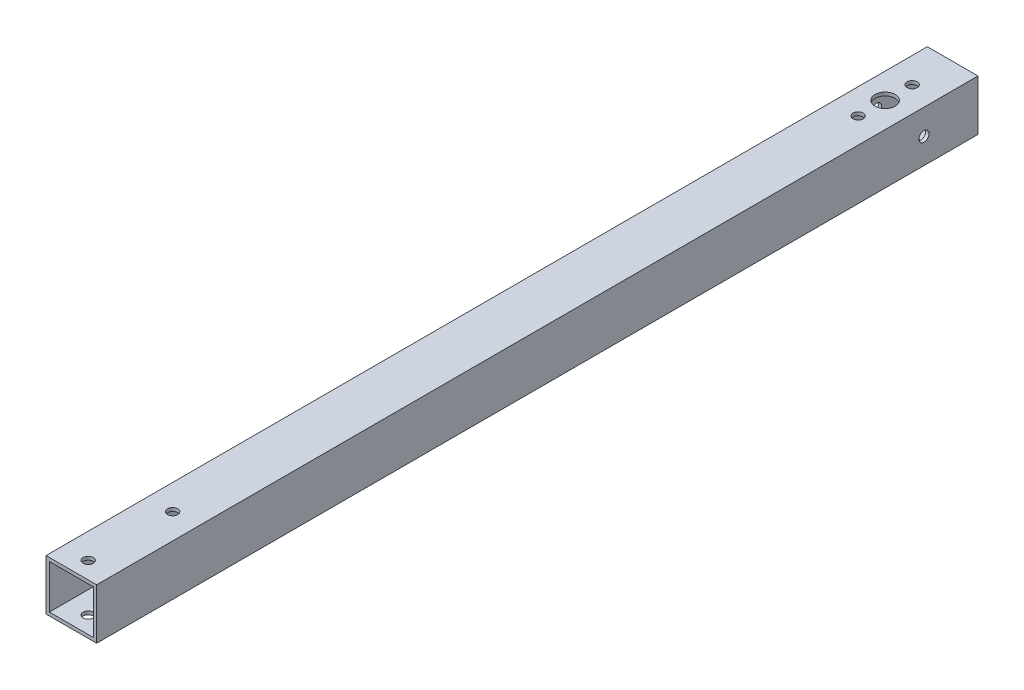
ISO-10303-21;
HEADER;
FILE_DESCRIPTION(('STEP AP214'),'2;1');
FILE_NAME('part.step','',(''),(''),'','','');
FILE_SCHEMA(('AUTOMOTIVE_DESIGN { 1 0 10303 214 1 1 1 1 }'));
ENDSEC;
DATA;
#1=APPLICATION_CONTEXT('core data for automotive mechanical design processes');
#2=APPLICATION_PROTOCOL_DEFINITION('international standard','automotive_design',2000,#1);
#3=PRODUCT_CONTEXT('',#1,'mechanical');
#4=PRODUCT('Part','Part','',(#3));
#5=PRODUCT_RELATED_PRODUCT_CATEGORY('part','',(#4));
#6=PRODUCT_DEFINITION_FORMATION('','',#4);
#7=PRODUCT_DEFINITION_CONTEXT('part definition',#1,'design');
#8=PRODUCT_DEFINITION('design','',#6,#7);
#9=PRODUCT_DEFINITION_SHAPE('','',#8);
#10=(LENGTH_UNIT() NAMED_UNIT(*) SI_UNIT(.MILLI.,.METRE.));
#11=(NAMED_UNIT(*) PLANE_ANGLE_UNIT() SI_UNIT($,.RADIAN.));
#12=(NAMED_UNIT(*) SI_UNIT($,.STERADIAN.) SOLID_ANGLE_UNIT());
#13=UNCERTAINTY_MEASURE_WITH_UNIT(LENGTH_MEASURE(1.E-05),#10,'distance_accuracy_value','');
#14=(GEOMETRIC_REPRESENTATION_CONTEXT(3) GLOBAL_UNCERTAINTY_ASSIGNED_CONTEXT((#13)) GLOBAL_UNIT_ASSIGNED_CONTEXT((#10,
#11,#12)) REPRESENTATION_CONTEXT('',''));
#15=CARTESIAN_POINT('',(0.,0.,0.));
#16=DIRECTION('',(0.,0.,1.));
#17=DIRECTION('',(1.,0.,0.));
#18=AXIS2_PLACEMENT_3D('',#15,#16,#17);
#19=CARTESIAN_POINT('',(-44.2961417863926,22.1480708931963,261.));
#20=DIRECTION('',(1.,0.,0.));
#21=DIRECTION('',(0.,0.,-1.));
#22=AXIS2_PLACEMENT_3D('',#19,#20,#21);
#23=PLANE('',#22);
#24=CARTESIAN_POINT('',(-44.2961417863926,14.6480708931963,16.));
#25=DIRECTION('',(-1.,0.,0.));
#26=DIRECTION('',(0.,0.,1.));
#27=AXIS2_PLACEMENT_3D('',#24,#25,#26);
#28=CIRCLE('',#27,1.49999999999999);
#29=CARTESIAN_POINT('',(-44.2961417863926,14.6480708931963,17.5));
#30=VERTEX_POINT('',#29);
#31=EDGE_CURVE('E255',#30,#30,#28,.T.);
#32=ORIENTED_EDGE('',*,*,#31,.F.);
#33=EDGE_LOOP('',(#32));
#34=FACE_BOUND('',#33,.T.);
#35=DIRECTION('',(0.,-1.,0.));
#36=VECTOR('',#35,1.);
#37=CARTESIAN_POINT('',(-44.2961417863926,22.1480708931963,0.));
#38=LINE('',#37,#36);
#39=CARTESIAN_POINT('',(-44.2961417863926,22.1480708931963,0.));
#40=VERTEX_POINT('',#39);
#41=CARTESIAN_POINT('',(-44.2961417863926,7.14807089319633,0.));
#42=VERTEX_POINT('',#41);
#43=EDGE_CURVE('E136',#40,#42,#38,.T.);
#44=ORIENTED_EDGE('',*,*,#43,.T.);
#45=DIRECTION('',(0.,0.,-1.));
#46=VECTOR('',#45,1.);
#47=CARTESIAN_POINT('',(-44.2961417863926,7.14807089319633,261.));
#48=LINE('',#47,#46);
#49=CARTESIAN_POINT('',(-44.2961417863926,7.14807089319633,261.));
#50=VERTEX_POINT('',#49);
#51=EDGE_CURVE('E11',#50,#42,#48,.T.);
#52=ORIENTED_EDGE('',*,*,#51,.F.);
#53=DIRECTION('',(0.,-1.,0.));
#54=VECTOR('',#53,1.);
#55=CARTESIAN_POINT('',(-44.2961417863926,22.1480708931963,261.));
#56=LINE('',#55,#54);
#57=CARTESIAN_POINT('',(-44.2961417863926,22.1480708931963,261.));
#58=VERTEX_POINT('',#57);
#59=EDGE_CURVE('E140',#58,#50,#56,.T.);
#60=ORIENTED_EDGE('',*,*,#59,.F.);
#61=DIRECTION('',(0.,0.,-1.));
#62=VECTOR('',#61,1.);
#63=CARTESIAN_POINT('',(-44.2961417863926,22.1480708931963,261.));
#64=LINE('',#63,#62);
#65=EDGE_CURVE('E150',#58,#40,#64,.T.);
#66=ORIENTED_EDGE('',*,*,#65,.T.);
#67=EDGE_LOOP('',(#44,#52,#60,#66));
#68=FACE_BOUND('',#67,.T.);
#69=ADVANCED_FACE('F34',(#34,#68),#23,.F.);
#70=CARTESIAN_POINT('',(-44.2961417863926,7.14807089319633,261.));
#71=DIRECTION('',(0.,1.,0.));
#72=DIRECTION('',(0.,0.,1.));
#73=AXIS2_PLACEMENT_3D('',#70,#71,#72);
#74=PLANE('',#73);
#75=CARTESIAN_POINT('',(-36.7961417863926,7.14807089319633,12.));
#76=DIRECTION('',(0.,1.,0.));
#77=DIRECTION('',(0.,0.,1.));
#78=AXIS2_PLACEMENT_3D('',#75,#76,#77);
#79=CIRCLE('',#78,1.49999999999999);
#80=CARTESIAN_POINT('',(-36.7961417863926,7.14807089319633,13.5));
#81=VERTEX_POINT('',#80);
#82=EDGE_CURVE('E182',#81,#81,#79,.T.);
#83=ORIENTED_EDGE('',*,*,#82,.T.);
#84=EDGE_LOOP('',(#83));
#85=FACE_BOUND('',#84,.T.);
#86=CARTESIAN_POINT('',(-36.7961417863926,7.14807089319633,28.));
#87=DIRECTION('',(0.,1.,0.));
#88=DIRECTION('',(0.,0.,1.));
#89=AXIS2_PLACEMENT_3D('',#86,#87,#88);
#90=CIRCLE('',#89,1.49999999999999);
#91=CARTESIAN_POINT('',(-36.7961417863926,7.14807089319633,29.5));
#92=VERTEX_POINT('',#91);
#93=EDGE_CURVE('E178',#92,#92,#90,.T.);
#94=ORIENTED_EDGE('',*,*,#93,.T.);
#95=EDGE_LOOP('',(#94));
#96=FACE_BOUND('',#95,.T.);
#97=CARTESIAN_POINT('',(-36.7961417863926,7.14807089319633,256.));
#98=DIRECTION('',(0.,1.,0.));
#99=DIRECTION('',(0.,0.,1.));
#100=AXIS2_PLACEMENT_3D('',#97,#98,#99);
#101=CIRCLE('',#100,1.49999999999999);
#102=CARTESIAN_POINT('',(-36.7961417863926,7.14807089319633,257.5));
#103=VERTEX_POINT('',#102);
#104=EDGE_CURVE('E173',#103,#103,#101,.T.);
#105=ORIENTED_EDGE('',*,*,#104,.T.);
#106=EDGE_LOOP('',(#105));
#107=FACE_BOUND('',#106,.T.);
#108=CARTESIAN_POINT('',(-36.7961417863926,7.14807089319633,231.));
#109=DIRECTION('',(0.,1.,0.));
#110=DIRECTION('',(0.,0.,1.));
#111=AXIS2_PLACEMENT_3D('',#108,#109,#110);
#112=CIRCLE('',#111,1.49999999999999);
#113=CARTESIAN_POINT('',(-36.7961417863926,7.14807089319633,232.5));
#114=VERTEX_POINT('',#113);
#115=EDGE_CURVE('E168',#114,#114,#112,.T.);
#116=ORIENTED_EDGE('',*,*,#115,.T.);
#117=EDGE_LOOP('',(#116));
#118=FACE_BOUND('',#117,.T.);
#119=DIRECTION('',(1.,0.,0.));
#120=VECTOR('',#119,1.);
#121=CARTESIAN_POINT('',(-44.2961417863926,7.14807089319633,0.));
#122=LINE('',#121,#120);
#123=CARTESIAN_POINT('',(-29.2961417863926,7.14807089319633,0.));
#124=VERTEX_POINT('',#123);
#125=EDGE_CURVE('E153',#42,#124,#122,.T.);
#126=ORIENTED_EDGE('',*,*,#125,.T.);
#127=DIRECTION('',(0.,0.,-1.));
#128=VECTOR('',#127,1.);
#129=CARTESIAN_POINT('',(-29.2961417863926,7.14807089319633,261.));
#130=LINE('',#129,#128);
#131=CARTESIAN_POINT('',(-29.2961417863926,7.14807089319633,261.));
#132=VERTEX_POINT('',#131);
#133=EDGE_CURVE('E42',#132,#124,#130,.T.);
#134=ORIENTED_EDGE('',*,*,#133,.F.);
#135=DIRECTION('',(1.,0.,0.));
#136=VECTOR('',#135,1.);
#137=CARTESIAN_POINT('',(-44.2961417863926,7.14807089319633,261.));
#138=LINE('',#137,#136);
#139=EDGE_CURVE('E143',#50,#132,#138,.T.);
#140=ORIENTED_EDGE('',*,*,#139,.F.);
#141=ORIENTED_EDGE('',*,*,#51,.T.);
#142=EDGE_LOOP('',(#126,#134,#140,#141));
#143=FACE_BOUND('',#142,.T.);
#144=ADVANCED_FACE('F223',(#85,#96,#107,#118,#143),#74,.F.);
#145=CARTESIAN_POINT('',(-29.2961417863926,22.1480708931963,261.));
#146=DIRECTION('',(-1.,0.,0.));
#147=DIRECTION('',(0.,-1.,0.));
#148=AXIS2_PLACEMENT_3D('',#145,#146,#147);
#149=PLANE('',#148);
#150=CARTESIAN_POINT('',(-29.2961417863926,14.6480708931963,16.));
#151=DIRECTION('',(-1.,0.,0.));
#152=DIRECTION('',(0.,0.,1.));
#153=AXIS2_PLACEMENT_3D('',#150,#151,#152);
#154=CIRCLE('',#153,1.5);
#155=CARTESIAN_POINT('',(-29.2961417863926,14.6480708931963,17.5));
#156=VERTEX_POINT('',#155);
#157=EDGE_CURVE('E505',#156,#156,#154,.T.);
#158=ORIENTED_EDGE('',*,*,#157,.T.);
#159=EDGE_LOOP('',(#158));
#160=FACE_BOUND('',#159,.T.);
#161=DIRECTION('',(0.,1.,0.));
#162=VECTOR('',#161,1.);
#163=CARTESIAN_POINT('',(-29.2961417863926,22.1480708931963,0.));
#164=LINE('',#163,#162);
#165=CARTESIAN_POINT('',(-29.2961417863926,22.1480708931963,0.));
#166=VERTEX_POINT('',#165);
#167=EDGE_CURVE('E155',#124,#166,#164,.T.);
#168=ORIENTED_EDGE('',*,*,#167,.T.);
#169=DIRECTION('',(0.,0.,-1.));
#170=VECTOR('',#169,1.);
#171=CARTESIAN_POINT('',(-29.2961417863926,22.1480708931963,261.));
#172=LINE('',#171,#170);
#173=CARTESIAN_POINT('',(-29.2961417863926,22.1480708931963,261.));
#174=VERTEX_POINT('',#173);
#175=EDGE_CURVE('E160',#174,#166,#172,.T.);
#176=ORIENTED_EDGE('',*,*,#175,.F.);
#177=DIRECTION('',(0.,1.,0.));
#178=VECTOR('',#177,1.);
#179=CARTESIAN_POINT('',(-29.2961417863926,22.1480708931963,261.));
#180=LINE('',#179,#178);
#181=EDGE_CURVE('E146',#132,#174,#180,.T.);
#182=ORIENTED_EDGE('',*,*,#181,.F.);
#183=ORIENTED_EDGE('',*,*,#133,.T.);
#184=EDGE_LOOP('',(#168,#176,#182,#183));
#185=FACE_BOUND('',#184,.T.);
#186=ADVANCED_FACE('F250',(#160,#185),#149,.F.);
#187=CARTESIAN_POINT('',(-44.2961417863926,22.1480708931963,261.));
#188=DIRECTION('',(0.,-1.,0.));
#189=DIRECTION('',(0.,0.,-1.));
#190=AXIS2_PLACEMENT_3D('',#187,#188,#189);
#191=PLANE('',#190);
#192=CARTESIAN_POINT('',(-36.7961417863926,22.1480708931963,20.));
#193=DIRECTION('',(0.,1.,0.));
#194=DIRECTION('',(0.,0.,1.));
#195=AXIS2_PLACEMENT_3D('',#192,#193,#194);
#196=CIRCLE('',#195,3.);
#197=CARTESIAN_POINT('',(-36.7961417863926,22.1480708931963,23.));
#198=VERTEX_POINT('',#197);
#199=EDGE_CURVE('E186',#198,#198,#196,.T.);
#200=ORIENTED_EDGE('',*,*,#199,.F.);
#201=EDGE_LOOP('',(#200));
#202=FACE_BOUND('',#201,.T.);
#203=CARTESIAN_POINT('',(-36.7961417863926,22.1480708931963,12.));
#204=DIRECTION('',(0.,1.,0.));
#205=DIRECTION('',(0.,0.,1.));
#206=AXIS2_PLACEMENT_3D('',#203,#204,#205);
#207=CIRCLE('',#206,1.49999999999999);
#208=CARTESIAN_POINT('',(-36.7961417863926,22.1480708931963,13.5));
#209=VERTEX_POINT('',#208);
#210=EDGE_CURVE('E185',#209,#209,#207,.T.);
#211=ORIENTED_EDGE('',*,*,#210,.F.);
#212=EDGE_LOOP('',(#211));
#213=FACE_BOUND('',#212,.T.);
#214=CARTESIAN_POINT('',(-36.7961417863926,22.1480708931963,28.));
#215=DIRECTION('',(0.,1.,0.));
#216=DIRECTION('',(0.,0.,1.));
#217=AXIS2_PLACEMENT_3D('',#214,#215,#216);
#218=CIRCLE('',#217,1.49999999999999);
#219=CARTESIAN_POINT('',(-36.7961417863926,22.1480708931963,29.5));
#220=VERTEX_POINT('',#219);
#221=EDGE_CURVE('E204',#220,#220,#218,.T.);
#222=ORIENTED_EDGE('',*,*,#221,.F.);
#223=EDGE_LOOP('',(#222));
#224=FACE_BOUND('',#223,.T.);
#225=CARTESIAN_POINT('',(-36.7961417863926,22.1480708931963,256.));
#226=DIRECTION('',(0.,1.,0.));
#227=DIRECTION('',(0.,0.,1.));
#228=AXIS2_PLACEMENT_3D('',#225,#226,#227);
#229=CIRCLE('',#228,1.49999999999999);
#230=CARTESIAN_POINT('',(-36.7961417863926,22.1480708931963,257.5));
#231=VERTEX_POINT('',#230);
#232=EDGE_CURVE('E211',#231,#231,#229,.T.);
#233=ORIENTED_EDGE('',*,*,#232,.F.);
#234=EDGE_LOOP('',(#233));
#235=FACE_BOUND('',#234,.T.);
#236=CARTESIAN_POINT('',(-36.7961417863926,22.1480708931963,231.));
#237=DIRECTION('',(0.,1.,0.));
#238=DIRECTION('',(0.,0.,1.));
#239=AXIS2_PLACEMENT_3D('',#236,#237,#238);
#240=CIRCLE('',#239,1.49999999999999);
#241=CARTESIAN_POINT('',(-36.7961417863926,22.1480708931963,232.5));
#242=VERTEX_POINT('',#241);
#243=EDGE_CURVE('E218',#242,#242,#240,.T.);
#244=ORIENTED_EDGE('',*,*,#243,.F.);
#245=EDGE_LOOP('',(#244));
#246=FACE_BOUND('',#245,.T.);
#247=DIRECTION('',(-1.,0.,0.));
#248=VECTOR('',#247,1.);
#249=CARTESIAN_POINT('',(-44.2961417863926,22.1480708931963,0.));
#250=LINE('',#249,#248);
#251=EDGE_CURVE('E144',#166,#40,#250,.T.);
#252=ORIENTED_EDGE('',*,*,#251,.T.);
#253=ORIENTED_EDGE('',*,*,#65,.F.);
#254=DIRECTION('',(-1.,0.,0.));
#255=VECTOR('',#254,1.);
#256=CARTESIAN_POINT('',(-44.2961417863926,22.1480708931963,261.));
#257=LINE('',#256,#255);
#258=EDGE_CURVE('E148',#174,#58,#257,.T.);
#259=ORIENTED_EDGE('',*,*,#258,.F.);
#260=ORIENTED_EDGE('',*,*,#175,.T.);
#261=EDGE_LOOP('',(#252,#253,#259,#260));
#262=FACE_BOUND('',#261,.T.);
#263=ADVANCED_FACE('F269',(#202,#213,#224,#235,#246,#262),#191,.F.);
#264=CARTESIAN_POINT('',(0.,0.,261.));
#265=DIRECTION('',(0.,0.,1.));
#266=DIRECTION('',(1.,0.,0.));
#267=AXIS2_PLACEMENT_3D('',#264,#265,#266);
#268=PLANE('',#267);
#269=DIRECTION('',(0.,-1.,0.));
#270=VECTOR('',#269,1.);
#271=CARTESIAN_POINT('',(-30.2961417863926,21.1480708931963,261.));
#272=LINE('',#271,#270);
#273=CARTESIAN_POINT('',(-30.2961417863926,21.1480708931963,261.));
#274=VERTEX_POINT('',#273);
#275=CARTESIAN_POINT('',(-30.2961417863926,8.14807089319633,261.));
#276=VERTEX_POINT('',#275);
#277=EDGE_CURVE('E102',#274,#276,#272,.T.);
#278=ORIENTED_EDGE('',*,*,#277,.T.);
#279=DIRECTION('',(-1.,0.,0.));
#280=VECTOR('',#279,1.);
#281=CARTESIAN_POINT('',(-30.2961417863926,8.14807089319633,261.));
#282=LINE('',#281,#280);
#283=CARTESIAN_POINT('',(-43.2961417863926,8.14807089319633,261.));
#284=VERTEX_POINT('',#283);
#285=EDGE_CURVE('E111',#276,#284,#282,.T.);
#286=ORIENTED_EDGE('',*,*,#285,.T.);
#287=DIRECTION('',(0.,1.,0.));
#288=VECTOR('',#287,1.);
#289=CARTESIAN_POINT('',(-43.2961417863926,21.1480708931963,261.));
#290=LINE('',#289,#288);
#291=CARTESIAN_POINT('',(-43.2961417863926,21.1480708931963,261.));
#292=VERTEX_POINT('',#291);
#293=EDGE_CURVE('E50',#284,#292,#290,.T.);
#294=ORIENTED_EDGE('',*,*,#293,.T.);
#295=DIRECTION('',(1.,0.,0.));
#296=VECTOR('',#295,1.);
#297=CARTESIAN_POINT('',(-30.2961417863926,21.1480708931963,261.));
#298=LINE('',#297,#296);
#299=EDGE_CURVE('E108',#292,#274,#298,.T.);
#300=ORIENTED_EDGE('',*,*,#299,.T.);
#301=EDGE_LOOP('',(#278,#286,#294,#300));
#302=FACE_BOUND('',#301,.T.);
#303=ORIENTED_EDGE('',*,*,#59,.T.);
#304=ORIENTED_EDGE('',*,*,#139,.T.);
#305=ORIENTED_EDGE('',*,*,#181,.T.);
#306=ORIENTED_EDGE('',*,*,#258,.T.);
#307=EDGE_LOOP('',(#303,#304,#305,#306));
#308=FACE_BOUND('',#307,.T.);
#309=ADVANCED_FACE('F115',(#302,#308),#268,.T.);
#310=CARTESIAN_POINT('',(0.,0.,0.));
#311=DIRECTION('',(0.,0.,1.));
#312=DIRECTION('',(1.,0.,0.));
#313=AXIS2_PLACEMENT_3D('',#310,#311,#312);
#314=PLANE('',#313);
#315=DIRECTION('',(-1.,0.,0.));
#316=VECTOR('',#315,1.);
#317=CARTESIAN_POINT('',(-30.2961417863926,8.14807089319633,0.));
#318=LINE('',#317,#316);
#319=CARTESIAN_POINT('',(-30.2961417863926,8.14807089319633,0.));
#320=VERTEX_POINT('',#319);
#321=CARTESIAN_POINT('',(-43.2961417863926,8.14807089319633,0.));
#322=VERTEX_POINT('',#321);
#323=EDGE_CURVE('E130',#320,#322,#318,.T.);
#324=ORIENTED_EDGE('',*,*,#323,.F.);
#325=DIRECTION('',(0.,-1.,0.));
#326=VECTOR('',#325,1.);
#327=CARTESIAN_POINT('',(-30.2961417863926,21.1480708931963,0.));
#328=LINE('',#327,#326);
#329=CARTESIAN_POINT('',(-30.2961417863926,21.1480708931963,0.));
#330=VERTEX_POINT('',#329);
#331=EDGE_CURVE('E58',#330,#320,#328,.T.);
#332=ORIENTED_EDGE('',*,*,#331,.F.);
#333=DIRECTION('',(1.,0.,0.));
#334=VECTOR('',#333,1.);
#335=CARTESIAN_POINT('',(-30.2961417863926,21.1480708931963,0.));
#336=LINE('',#335,#334);
#337=CARTESIAN_POINT('',(-43.2961417863926,21.1480708931963,0.));
#338=VERTEX_POINT('',#337);
#339=EDGE_CURVE('E118',#338,#330,#336,.T.);
#340=ORIENTED_EDGE('',*,*,#339,.F.);
#341=DIRECTION('',(0.,1.,0.));
#342=VECTOR('',#341,1.);
#343=CARTESIAN_POINT('',(-43.2961417863926,21.1480708931963,0.));
#344=LINE('',#343,#342);
#345=EDGE_CURVE('E121',#322,#338,#344,.T.);
#346=ORIENTED_EDGE('',*,*,#345,.F.);
#347=EDGE_LOOP('',(#324,#332,#340,#346));
#348=FACE_BOUND('',#347,.T.);
#349=ORIENTED_EDGE('',*,*,#43,.F.);
#350=ORIENTED_EDGE('',*,*,#251,.F.);
#351=ORIENTED_EDGE('',*,*,#167,.F.);
#352=ORIENTED_EDGE('',*,*,#125,.F.);
#353=EDGE_LOOP('',(#349,#350,#351,#352));
#354=FACE_BOUND('',#353,.T.);
#355=ADVANCED_FACE('F262',(#348,#354),#314,.F.);
#356=CARTESIAN_POINT('',(-30.2961417863926,21.1480708931963,261.));
#357=DIRECTION('',(1.,0.,0.));
#358=DIRECTION('',(0.,0.,-1.));
#359=AXIS2_PLACEMENT_3D('',#356,#357,#358);
#360=PLANE('',#359);
#361=CARTESIAN_POINT('',(-30.2961417863926,14.6480708931963,16.));
#362=DIRECTION('',(1.,0.,0.));
#363=DIRECTION('',(0.,0.,-1.));
#364=AXIS2_PLACEMENT_3D('',#361,#362,#363);
#365=CIRCLE('',#364,1.49999999999999);
#366=CARTESIAN_POINT('',(-30.2961417863926,14.6480708931963,14.5));
#367=VERTEX_POINT('',#366);
#368=EDGE_CURVE('E192',#367,#367,#365,.T.);
#369=ORIENTED_EDGE('',*,*,#368,.T.);
#370=EDGE_LOOP('',(#369));
#371=FACE_BOUND('',#370,.T.);
#372=ORIENTED_EDGE('',*,*,#331,.T.);
#373=DIRECTION('',(0.,0.,-1.));
#374=VECTOR('',#373,1.);
#375=CARTESIAN_POINT('',(-30.2961417863926,8.14807089319633,261.));
#376=LINE('',#375,#374);
#377=EDGE_CURVE('E98',#276,#320,#376,.T.);
#378=ORIENTED_EDGE('',*,*,#377,.F.);
#379=ORIENTED_EDGE('',*,*,#277,.F.);
#380=DIRECTION('',(0.,0.,-1.));
#381=VECTOR('',#380,1.);
#382=CARTESIAN_POINT('',(-30.2961417863926,21.1480708931963,261.));
#383=LINE('',#382,#381);
#384=EDGE_CURVE('E134',#274,#330,#383,.T.);
#385=ORIENTED_EDGE('',*,*,#384,.T.);
#386=EDGE_LOOP('',(#372,#378,#379,#385));
#387=FACE_BOUND('',#386,.T.);
#388=ADVANCED_FACE('F100',(#371,#387),#360,.F.);
#389=CARTESIAN_POINT('',(-30.2961417863926,21.1480708931963,261.));
#390=DIRECTION('',(0.,1.,0.));
#391=DIRECTION('',(0.,0.,1.));
#392=AXIS2_PLACEMENT_3D('',#389,#390,#391);
#393=PLANE('',#392);
#394=CARTESIAN_POINT('',(-36.7961417863926,21.1480708931963,20.));
#395=DIRECTION('',(0.,1.,0.));
#396=DIRECTION('',(0.,0.,1.));
#397=AXIS2_PLACEMENT_3D('',#394,#395,#396);
#398=CIRCLE('',#397,3.);
#399=CARTESIAN_POINT('',(-36.7961417863926,21.1480708931963,23.));
#400=VERTEX_POINT('',#399);
#401=EDGE_CURVE('E183',#400,#400,#398,.T.);
#402=ORIENTED_EDGE('',*,*,#401,.T.);
#403=EDGE_LOOP('',(#402));
#404=FACE_BOUND('',#403,.T.);
#405=CARTESIAN_POINT('',(-36.7961417863926,21.1480708931963,12.));
#406=DIRECTION('',(0.,1.,0.));
#407=DIRECTION('',(0.,0.,1.));
#408=AXIS2_PLACEMENT_3D('',#405,#406,#407);
#409=CIRCLE('',#408,1.49999999999999);
#410=CARTESIAN_POINT('',(-36.7961417863926,21.1480708931963,13.5));
#411=VERTEX_POINT('',#410);
#412=EDGE_CURVE('E181',#411,#411,#409,.T.);
#413=ORIENTED_EDGE('',*,*,#412,.T.);
#414=EDGE_LOOP('',(#413));
#415=FACE_BOUND('',#414,.T.);
#416=CARTESIAN_POINT('',(-36.7961417863926,21.1480708931963,28.));
#417=DIRECTION('',(0.,1.,0.));
#418=DIRECTION('',(0.,0.,1.));
#419=AXIS2_PLACEMENT_3D('',#416,#417,#418);
#420=CIRCLE('',#419,1.49999999999999);
#421=CARTESIAN_POINT('',(-36.7961417863926,21.1480708931963,29.5));
#422=VERTEX_POINT('',#421);
#423=EDGE_CURVE('E177',#422,#422,#420,.T.);
#424=ORIENTED_EDGE('',*,*,#423,.T.);
#425=EDGE_LOOP('',(#424));
#426=FACE_BOUND('',#425,.T.);
#427=CARTESIAN_POINT('',(-36.7961417863926,21.1480708931963,256.));
#428=DIRECTION('',(0.,1.,0.));
#429=DIRECTION('',(0.,0.,1.));
#430=AXIS2_PLACEMENT_3D('',#427,#428,#429);
#431=CIRCLE('',#430,1.49999999999999);
#432=CARTESIAN_POINT('',(-36.7961417863926,21.1480708931963,257.5));
#433=VERTEX_POINT('',#432);
#434=EDGE_CURVE('E172',#433,#433,#431,.T.);
#435=ORIENTED_EDGE('',*,*,#434,.T.);
#436=EDGE_LOOP('',(#435));
#437=FACE_BOUND('',#436,.T.);
#438=CARTESIAN_POINT('',(-36.7961417863926,21.1480708931963,231.));
#439=DIRECTION('',(0.,1.,0.));
#440=DIRECTION('',(0.,0.,1.));
#441=AXIS2_PLACEMENT_3D('',#438,#439,#440);
#442=CIRCLE('',#441,1.49999999999999);
#443=CARTESIAN_POINT('',(-36.7961417863926,21.1480708931963,232.5));
#444=VERTEX_POINT('',#443);
#445=EDGE_CURVE('E124',#444,#444,#442,.T.);
#446=ORIENTED_EDGE('',*,*,#445,.T.);
#447=EDGE_LOOP('',(#446));
#448=FACE_BOUND('',#447,.T.);
#449=ORIENTED_EDGE('',*,*,#339,.T.);
#450=ORIENTED_EDGE('',*,*,#384,.F.);
#451=ORIENTED_EDGE('',*,*,#299,.F.);
#452=DIRECTION('',(0.,0.,-1.));
#453=VECTOR('',#452,1.);
#454=CARTESIAN_POINT('',(-43.2961417863926,21.1480708931963,261.));
#455=LINE('',#454,#453);
#456=EDGE_CURVE('E137',#292,#338,#455,.T.);
#457=ORIENTED_EDGE('',*,*,#456,.T.);
#458=EDGE_LOOP('',(#449,#450,#451,#457));
#459=FACE_BOUND('',#458,.T.);
#460=ADVANCED_FACE('F240',(#404,#415,#426,#437,#448,#459),#393,.F.);
#461=CARTESIAN_POINT('',(-43.2961417863926,21.1480708931963,261.));
#462=DIRECTION('',(-1.,0.,0.));
#463=DIRECTION('',(0.,0.,1.));
#464=AXIS2_PLACEMENT_3D('',#461,#462,#463);
#465=PLANE('',#464);
#466=CARTESIAN_POINT('',(-43.2961417863926,14.6480708931963,16.));
#467=DIRECTION('',(-1.,0.,0.));
#468=DIRECTION('',(0.,0.,1.));
#469=AXIS2_PLACEMENT_3D('',#466,#467,#468);
#470=CIRCLE('',#469,1.49999999999999);
#471=CARTESIAN_POINT('',(-43.2961417863926,14.6480708931963,17.5));
#472=VERTEX_POINT('',#471);
#473=EDGE_CURVE('E37',#472,#472,#470,.T.);
#474=ORIENTED_EDGE('',*,*,#473,.T.);
#475=EDGE_LOOP('',(#474));
#476=FACE_BOUND('',#475,.T.);
#477=ORIENTED_EDGE('',*,*,#345,.T.);
#478=ORIENTED_EDGE('',*,*,#456,.F.);
#479=ORIENTED_EDGE('',*,*,#293,.F.);
#480=DIRECTION('',(0.,0.,-1.));
#481=VECTOR('',#480,1.);
#482=CARTESIAN_POINT('',(-43.2961417863926,8.14807089319633,261.));
#483=LINE('',#482,#481);
#484=EDGE_CURVE('E107',#284,#322,#483,.T.);
#485=ORIENTED_EDGE('',*,*,#484,.T.);
#486=EDGE_LOOP('',(#477,#478,#479,#485));
#487=FACE_BOUND('',#486,.T.);
#488=ADVANCED_FACE('F234',(#476,#487),#465,.F.);
#489=CARTESIAN_POINT('',(-30.2961417863926,8.14807089319633,261.));
#490=DIRECTION('',(0.,-1.,0.));
#491=DIRECTION('',(0.,0.,-1.));
#492=AXIS2_PLACEMENT_3D('',#489,#490,#491);
#493=PLANE('',#492);
#494=CARTESIAN_POINT('',(-36.7961417863926,8.14807089319633,12.));
#495=DIRECTION('',(0.,-1.,0.));
#496=DIRECTION('',(0.,0.,-1.));
#497=AXIS2_PLACEMENT_3D('',#494,#495,#496);
#498=CIRCLE('',#497,1.49999999999999);
#499=CARTESIAN_POINT('',(-36.7961417863926,8.14807089319633,10.5));
#500=VERTEX_POINT('',#499);
#501=EDGE_CURVE('E179',#500,#500,#498,.T.);
#502=ORIENTED_EDGE('',*,*,#501,.T.);
#503=EDGE_LOOP('',(#502));
#504=FACE_BOUND('',#503,.T.);
#505=CARTESIAN_POINT('',(-36.7961417863926,8.14807089319633,28.));
#506=DIRECTION('',(0.,-1.,0.));
#507=DIRECTION('',(0.,0.,-1.));
#508=AXIS2_PLACEMENT_3D('',#505,#506,#507);
#509=CIRCLE('',#508,1.49999999999999);
#510=CARTESIAN_POINT('',(-36.7961417863926,8.14807089319633,26.5));
#511=VERTEX_POINT('',#510);
#512=EDGE_CURVE('E174',#511,#511,#509,.T.);
#513=ORIENTED_EDGE('',*,*,#512,.T.);
#514=EDGE_LOOP('',(#513));
#515=FACE_BOUND('',#514,.T.);
#516=CARTESIAN_POINT('',(-36.7961417863926,8.14807089319633,256.));
#517=DIRECTION('',(0.,-1.,0.));
#518=DIRECTION('',(0.,0.,-1.));
#519=AXIS2_PLACEMENT_3D('',#516,#517,#518);
#520=CIRCLE('',#519,1.49999999999999);
#521=CARTESIAN_POINT('',(-36.7961417863926,8.14807089319633,254.5));
#522=VERTEX_POINT('',#521);
#523=EDGE_CURVE('E169',#522,#522,#520,.T.);
#524=ORIENTED_EDGE('',*,*,#523,.T.);
#525=EDGE_LOOP('',(#524));
#526=FACE_BOUND('',#525,.T.);
#527=CARTESIAN_POINT('',(-36.7961417863926,8.14807089319633,231.));
#528=DIRECTION('',(0.,-1.,0.));
#529=DIRECTION('',(0.,0.,-1.));
#530=AXIS2_PLACEMENT_3D('',#527,#528,#529);
#531=CIRCLE('',#530,1.49999999999999);
#532=CARTESIAN_POINT('',(-36.7961417863926,8.14807089319633,229.5));
#533=VERTEX_POINT('',#532);
#534=EDGE_CURVE('E165',#533,#533,#531,.T.);
#535=ORIENTED_EDGE('',*,*,#534,.T.);
#536=EDGE_LOOP('',(#535));
#537=FACE_BOUND('',#536,.T.);
#538=ORIENTED_EDGE('',*,*,#323,.T.);
#539=ORIENTED_EDGE('',*,*,#484,.F.);
#540=ORIENTED_EDGE('',*,*,#285,.F.);
#541=ORIENTED_EDGE('',*,*,#377,.T.);
#542=EDGE_LOOP('',(#538,#539,#540,#541));
#543=FACE_BOUND('',#542,.T.);
#544=ADVANCED_FACE('F112',(#504,#515,#526,#537,#543),#493,.F.);
#545=CARTESIAN_POINT('',(-36.7961417863926,22.1480708931963,231.));
#546=DIRECTION('',(0.,1.,0.));
#547=DIRECTION('',(0.,0.,1.));
#548=AXIS2_PLACEMENT_3D('',#545,#546,#547);
#549=CYLINDRICAL_SURFACE('',#548,1.49999999999999);
#550=ORIENTED_EDGE('',*,*,#115,.F.);
#551=EDGE_LOOP('',(#550));
#552=FACE_BOUND('',#551,.T.);
#553=ORIENTED_EDGE('',*,*,#534,.F.);
#554=EDGE_LOOP('',(#553));
#555=FACE_BOUND('',#554,.T.);
#556=ADVANCED_FACE('F226',(#552,#555),#549,.F.);
#557=ORIENTED_EDGE('',*,*,#243,.T.);
#558=EDGE_LOOP('',(#557));
#559=FACE_BOUND('',#558,.T.);
#560=ORIENTED_EDGE('',*,*,#445,.F.);
#561=EDGE_LOOP('',(#560));
#562=FACE_BOUND('',#561,.T.);
#563=ADVANCED_FACE('F229',(#559,#562),#549,.F.);
#564=CARTESIAN_POINT('',(-36.7961417863926,22.1480708931963,256.));
#565=DIRECTION('',(0.,1.,0.));
#566=DIRECTION('',(0.,0.,1.));
#567=AXIS2_PLACEMENT_3D('',#564,#565,#566);
#568=CYLINDRICAL_SURFACE('',#567,1.49999999999999);
#569=ORIENTED_EDGE('',*,*,#104,.F.);
#570=EDGE_LOOP('',(#569));
#571=FACE_BOUND('',#570,.T.);
#572=ORIENTED_EDGE('',*,*,#523,.F.);
#573=EDGE_LOOP('',(#572));
#574=FACE_BOUND('',#573,.T.);
#575=ADVANCED_FACE('F319',(#571,#574),#568,.F.);
#576=ORIENTED_EDGE('',*,*,#232,.T.);
#577=EDGE_LOOP('',(#576));
#578=FACE_BOUND('',#577,.T.);
#579=ORIENTED_EDGE('',*,*,#434,.F.);
#580=EDGE_LOOP('',(#579));
#581=FACE_BOUND('',#580,.T.);
#582=ADVANCED_FACE('F317',(#578,#581),#568,.F.);
#583=CARTESIAN_POINT('',(-36.7961417863926,22.1480708931963,28.));
#584=DIRECTION('',(0.,1.,0.));
#585=DIRECTION('',(0.,0.,1.));
#586=AXIS2_PLACEMENT_3D('',#583,#584,#585);
#587=CYLINDRICAL_SURFACE('',#586,1.49999999999999);
#588=ORIENTED_EDGE('',*,*,#93,.F.);
#589=EDGE_LOOP('',(#588));
#590=FACE_BOUND('',#589,.T.);
#591=ORIENTED_EDGE('',*,*,#512,.F.);
#592=EDGE_LOOP('',(#591));
#593=FACE_BOUND('',#592,.T.);
#594=ADVANCED_FACE('F315',(#590,#593),#587,.F.);
#595=ORIENTED_EDGE('',*,*,#221,.T.);
#596=EDGE_LOOP('',(#595));
#597=FACE_BOUND('',#596,.T.);
#598=ORIENTED_EDGE('',*,*,#423,.F.);
#599=EDGE_LOOP('',(#598));
#600=FACE_BOUND('',#599,.T.);
#601=ADVANCED_FACE('F312',(#597,#600),#587,.F.);
#602=CARTESIAN_POINT('',(-36.7961417863926,22.1480708931963,12.));
#603=DIRECTION('',(0.,1.,0.));
#604=DIRECTION('',(0.,0.,1.));
#605=AXIS2_PLACEMENT_3D('',#602,#603,#604);
#606=CYLINDRICAL_SURFACE('',#605,1.49999999999999);
#607=ORIENTED_EDGE('',*,*,#82,.F.);
#608=EDGE_LOOP('',(#607));
#609=FACE_BOUND('',#608,.T.);
#610=ORIENTED_EDGE('',*,*,#501,.F.);
#611=EDGE_LOOP('',(#610));
#612=FACE_BOUND('',#611,.T.);
#613=ADVANCED_FACE('F310',(#609,#612),#606,.F.);
#614=ORIENTED_EDGE('',*,*,#210,.T.);
#615=EDGE_LOOP('',(#614));
#616=FACE_BOUND('',#615,.T.);
#617=ORIENTED_EDGE('',*,*,#412,.F.);
#618=EDGE_LOOP('',(#617));
#619=FACE_BOUND('',#618,.T.);
#620=ADVANCED_FACE('F307',(#616,#619),#606,.F.);
#621=CARTESIAN_POINT('',(-36.7961417863926,22.1480708931963,20.));
#622=DIRECTION('',(0.,1.,0.));
#623=DIRECTION('',(0.,0.,1.));
#624=AXIS2_PLACEMENT_3D('',#621,#622,#623);
#625=CYLINDRICAL_SURFACE('',#624,3.);
#626=ORIENTED_EDGE('',*,*,#199,.T.);
#627=EDGE_LOOP('',(#626));
#628=FACE_BOUND('',#627,.T.);
#629=ORIENTED_EDGE('',*,*,#401,.F.);
#630=EDGE_LOOP('',(#629));
#631=FACE_BOUND('',#630,.T.);
#632=ADVANCED_FACE('F301',(#628,#631),#625,.F.);
#633=CARTESIAN_POINT('',(-44.2961417863926,14.6480708931963,16.));
#634=DIRECTION('',(-1.,0.,0.));
#635=DIRECTION('',(0.,0.,1.));
#636=AXIS2_PLACEMENT_3D('',#633,#634,#635);
#637=CYLINDRICAL_SURFACE('',#636,1.49999999999999);
#638=ORIENTED_EDGE('',*,*,#31,.T.);
#639=EDGE_LOOP('',(#638));
#640=FACE_BOUND('',#639,.T.);
#641=ORIENTED_EDGE('',*,*,#473,.F.);
#642=EDGE_LOOP('',(#641));
#643=FACE_BOUND('',#642,.T.);
#644=ADVANCED_FACE('F295',(#640,#643),#637,.F.);
#645=ORIENTED_EDGE('',*,*,#157,.F.);
#646=EDGE_LOOP('',(#645));
#647=FACE_BOUND('',#646,.T.);
#648=ORIENTED_EDGE('',*,*,#368,.F.);
#649=EDGE_LOOP('',(#648));
#650=FACE_BOUND('',#649,.T.);
#651=ADVANCED_FACE('F293',(#647,#650),#637,.F.);
#652=CLOSED_SHELL('',(#69,#144,#186,#263,#309,#355,#388,#460,#488,#544,#556,#563,#575,#582,#594,
#601,#613,#620,#632,#644,#651));
#653=MANIFOLD_SOLID_BREP('B2',#652);
#654=ADVANCED_BREP_SHAPE_REPRESENTATION('',(#18,#653),#14);
#655=SHAPE_DEFINITION_REPRESENTATION(#9,#654);
ENDSEC;
END-ISO-10303-21;
